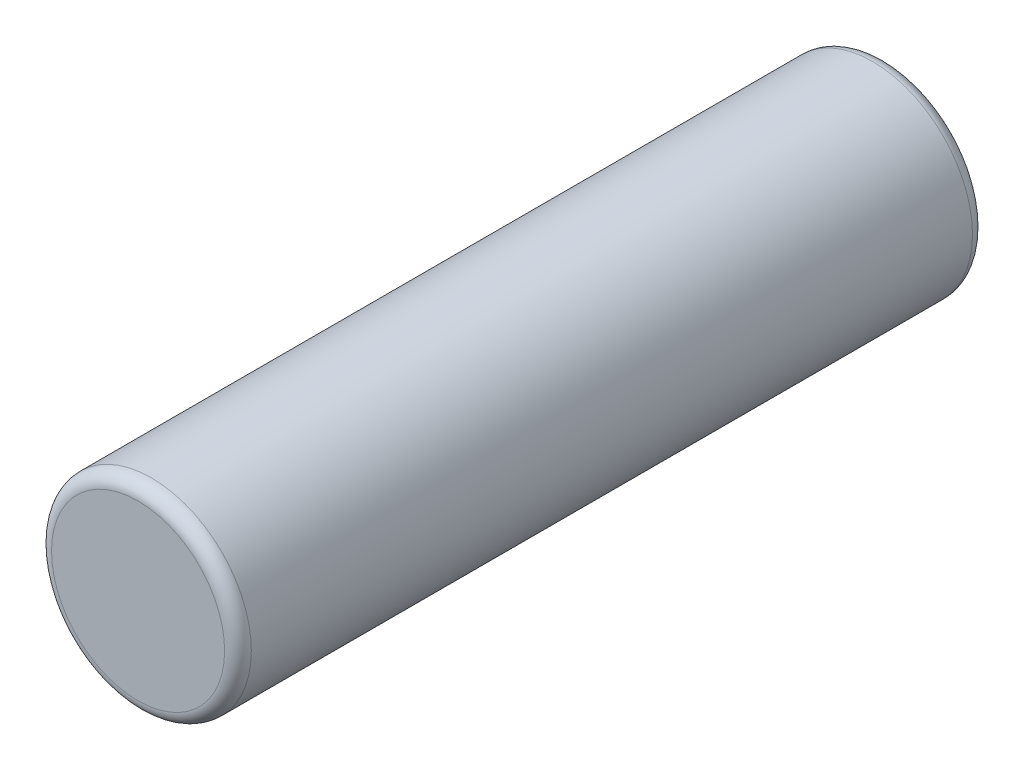
ISO-10303-21;
HEADER;
FILE_DESCRIPTION(('STEP AP214'),'2;1');
FILE_NAME('part.step','',(''),(''),'','','');
FILE_SCHEMA(('AUTOMOTIVE_DESIGN { 1 0 10303 214 1 1 1 1 }'));
ENDSEC;
DATA;
#1=APPLICATION_CONTEXT('core data for automotive mechanical design processes');
#2=APPLICATION_PROTOCOL_DEFINITION('international standard','automotive_design',2000,#1);
#3=PRODUCT_CONTEXT('',#1,'mechanical');
#4=PRODUCT('Part','Part','',(#3));
#5=PRODUCT_RELATED_PRODUCT_CATEGORY('part','',(#4));
#6=PRODUCT_DEFINITION_FORMATION('','',#4);
#7=PRODUCT_DEFINITION_CONTEXT('part definition',#1,'design');
#8=PRODUCT_DEFINITION('design','',#6,#7);
#9=PRODUCT_DEFINITION_SHAPE('','',#8);
#10=(LENGTH_UNIT() NAMED_UNIT(*) SI_UNIT(.MILLI.,.METRE.));
#11=(NAMED_UNIT(*) PLANE_ANGLE_UNIT() SI_UNIT($,.RADIAN.));
#12=(NAMED_UNIT(*) SI_UNIT($,.STERADIAN.) SOLID_ANGLE_UNIT());
#13=UNCERTAINTY_MEASURE_WITH_UNIT(LENGTH_MEASURE(1.E-05),#10,'distance_accuracy_value','');
#14=(GEOMETRIC_REPRESENTATION_CONTEXT(3) GLOBAL_UNCERTAINTY_ASSIGNED_CONTEXT((#13)) GLOBAL_UNIT_ASSIGNED_CONTEXT((#10,
#11,#12)) REPRESENTATION_CONTEXT('',''));
#15=CARTESIAN_POINT('',(0.,0.,0.));
#16=DIRECTION('',(0.,0.,1.));
#17=DIRECTION('',(1.,0.,0.));
#18=AXIS2_PLACEMENT_3D('',#15,#16,#17);
#19=CARTESIAN_POINT('',(0.,0.,-355.6));
#20=DIRECTION('',(0.,0.,1.));
#21=DIRECTION('',(1.,0.,0.));
#22=AXIS2_PLACEMENT_3D('',#19,#20,#21);
#23=CYLINDRICAL_SURFACE('',#22,47.498);
#24=CARTESIAN_POINT('',(0.,0.,-349.25));
#25=DIRECTION('',(0.,0.,1.));
#26=DIRECTION('',(1.,0.,0.));
#27=AXIS2_PLACEMENT_3D('',#24,#25,#26);
#28=CIRCLE('',#27,47.498);
#29=CARTESIAN_POINT('',(47.498,0.,-349.25));
#30=VERTEX_POINT('',#29);
#31=EDGE_CURVE('E52',#30,#30,#28,.T.);
#32=ORIENTED_EDGE('',*,*,#31,.T.);
#33=EDGE_LOOP('',(#32));
#34=FACE_BOUND('',#33,.T.);
#35=CARTESIAN_POINT('',(0.,0.,-6.35000000000002));
#36=DIRECTION('',(0.,0.,1.));
#37=DIRECTION('',(1.,0.,0.));
#38=AXIS2_PLACEMENT_3D('',#35,#36,#37);
#39=CIRCLE('',#38,47.498);
#40=CARTESIAN_POINT('',(47.498,0.,-6.35000000000002));
#41=VERTEX_POINT('',#40);
#42=EDGE_CURVE('E56',#41,#41,#39,.F.);
#43=ORIENTED_EDGE('',*,*,#42,.T.);
#44=EDGE_LOOP('',(#43));
#45=FACE_BOUND('',#44,.T.);
#46=ADVANCED_FACE('F41',(#34,#45),#23,.T.);
#47=CARTESIAN_POINT('',(0.,0.,-355.6));
#48=DIRECTION('',(0.,0.,1.));
#49=DIRECTION('',(1.,0.,0.));
#50=AXIS2_PLACEMENT_3D('',#47,#48,#49);
#51=PLANE('',#50);
#52=CARTESIAN_POINT('',(0.,0.,-355.6));
#53=DIRECTION('',(0.,0.,1.));
#54=DIRECTION('',(1.,0.,0.));
#55=AXIS2_PLACEMENT_3D('',#52,#53,#54);
#56=CIRCLE('',#55,41.148);
#57=CARTESIAN_POINT('',(41.148,0.,-355.6));
#58=VERTEX_POINT('',#57);
#59=EDGE_CURVE('E48',#58,#58,#56,.F.);
#60=ORIENTED_EDGE('',*,*,#59,.T.);
#61=EDGE_LOOP('',(#60));
#62=FACE_BOUND('',#61,.T.);
#63=ADVANCED_FACE('F72',(#62),#51,.F.);
#64=CARTESIAN_POINT('',(0.,0.,0.));
#65=DIRECTION('',(0.,0.,1.));
#66=DIRECTION('',(1.,0.,0.));
#67=AXIS2_PLACEMENT_3D('',#64,#65,#66);
#68=PLANE('',#67);
#69=CARTESIAN_POINT('',(0.,0.,0.));
#70=DIRECTION('',(0.,0.,1.));
#71=DIRECTION('',(1.,0.,0.));
#72=AXIS2_PLACEMENT_3D('',#69,#70,#71);
#73=CIRCLE('',#72,41.148);
#74=CARTESIAN_POINT('',(41.148,0.,0.));
#75=VERTEX_POINT('',#74);
#76=EDGE_CURVE('E10',#75,#75,#73,.T.);
#77=ORIENTED_EDGE('',*,*,#76,.T.);
#78=EDGE_LOOP('',(#77));
#79=FACE_BOUND('',#78,.T.);
#80=ADVANCED_FACE('F69',(#79),#68,.T.);
#81=CARTESIAN_POINT('',(0.,0.,-349.25));
#82=DIRECTION('',(0.,0.,1.));
#83=DIRECTION('',(1.,0.,0.));
#84=AXIS2_PLACEMENT_3D('',#81,#82,#83);
#85=TOROIDAL_SURFACE('',#84,41.148,6.35);
#86=ORIENTED_EDGE('',*,*,#59,.F.);
#87=EDGE_LOOP('',(#86));
#88=FACE_BOUND('',#87,.T.);
#89=ORIENTED_EDGE('',*,*,#31,.F.);
#90=EDGE_LOOP('',(#89));
#91=FACE_BOUND('',#90,.T.);
#92=ADVANCED_FACE('F65',(#88,#91),#85,.T.);
#93=CARTESIAN_POINT('',(0.,0.,-6.35000000000002));
#94=DIRECTION('',(0.,0.,1.));
#95=DIRECTION('',(1.,0.,0.));
#96=AXIS2_PLACEMENT_3D('',#93,#94,#95);
#97=TOROIDAL_SURFACE('',#96,41.148,6.35);
#98=ORIENTED_EDGE('',*,*,#42,.F.);
#99=EDGE_LOOP('',(#98));
#100=FACE_BOUND('',#99,.T.);
#101=ORIENTED_EDGE('',*,*,#76,.F.);
#102=EDGE_LOOP('',(#101));
#103=FACE_BOUND('',#102,.T.);
#104=ADVANCED_FACE('F43',(#100,#103),#97,.T.);
#105=CLOSED_SHELL('',(#46,#63,#80,#92,#104));
#106=MANIFOLD_SOLID_BREP('B2',#105);
#107=ADVANCED_BREP_SHAPE_REPRESENTATION('',(#18,#106),#14);
#108=SHAPE_DEFINITION_REPRESENTATION(#9,#107);
ENDSEC;
END-ISO-10303-21;
